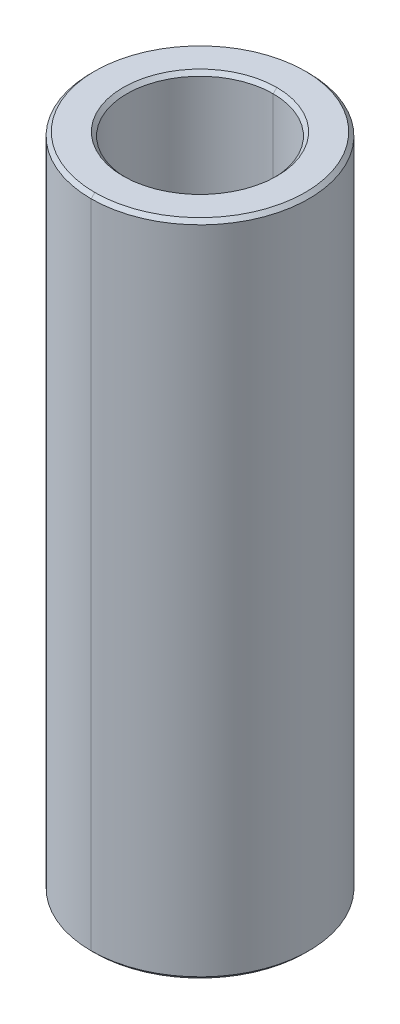
ISO-10303-21;
HEADER;
FILE_DESCRIPTION(('STEP AP214'),'2;1');
FILE_NAME('part.step','',(''),(''),'','','');
FILE_SCHEMA(('AUTOMOTIVE_DESIGN { 1 0 10303 214 1 1 1 1 }'));
ENDSEC;
DATA;
#1=APPLICATION_CONTEXT('core data for automotive mechanical design processes');
#2=APPLICATION_PROTOCOL_DEFINITION('international standard','automotive_design',2000,#1);
#3=PRODUCT_CONTEXT('',#1,'mechanical');
#4=PRODUCT('Part','Part','',(#3));
#5=PRODUCT_RELATED_PRODUCT_CATEGORY('part','',(#4));
#6=PRODUCT_DEFINITION_FORMATION('','',#4);
#7=PRODUCT_DEFINITION_CONTEXT('part definition',#1,'design');
#8=PRODUCT_DEFINITION('design','',#6,#7);
#9=PRODUCT_DEFINITION_SHAPE('','',#8);
#10=(LENGTH_UNIT() NAMED_UNIT(*) SI_UNIT(.MILLI.,.METRE.));
#11=(NAMED_UNIT(*) PLANE_ANGLE_UNIT() SI_UNIT($,.RADIAN.));
#12=(NAMED_UNIT(*) SI_UNIT($,.STERADIAN.) SOLID_ANGLE_UNIT());
#13=UNCERTAINTY_MEASURE_WITH_UNIT(LENGTH_MEASURE(1.E-05),#10,'distance_accuracy_value','');
#14=(GEOMETRIC_REPRESENTATION_CONTEXT(3) GLOBAL_UNCERTAINTY_ASSIGNED_CONTEXT((#13)) GLOBAL_UNIT_ASSIGNED_CONTEXT((#10,
#11,#12)) REPRESENTATION_CONTEXT('',''));
#15=CARTESIAN_POINT('',(0.,0.,0.));
#16=DIRECTION('',(0.,0.,1.));
#17=DIRECTION('',(1.,0.,0.));
#18=AXIS2_PLACEMENT_3D('',#15,#16,#17);
#19=CARTESIAN_POINT('',(0.,8.9,0.));
#20=DIRECTION('',(0.,1.,0.));
#21=DIRECTION('',(0.,0.,1.));
#22=AXIS2_PLACEMENT_3D('',#19,#20,#21);
#23=CONICAL_SURFACE('',#22,2.,0.785398163397448);
#24=DIRECTION('',(0.,0.707106781186548,-0.707106781186548));
#25=VECTOR('',#24,1.);
#26=CARTESIAN_POINT('',(0.,8.9,-2.));
#27=LINE('',#26,#25);
#28=CARTESIAN_POINT('',(0.,8.9,-2.));
#29=VERTEX_POINT('',#28);
#30=CARTESIAN_POINT('',(0.,9.,-2.1));
#31=VERTEX_POINT('',#30);
#32=EDGE_CURVE('E103',#29,#31,#27,.T.);
#33=ORIENTED_EDGE('',*,*,#32,.F.);
#34=CARTESIAN_POINT('',(0.,8.9,0.));
#35=DIRECTION('',(0.,1.,0.));
#36=DIRECTION('',(0.,0.,1.));
#37=AXIS2_PLACEMENT_3D('',#34,#35,#36);
#38=CIRCLE('',#37,2.);
#39=CARTESIAN_POINT('',(0.,8.9,2.));
#40=VERTEX_POINT('',#39);
#41=EDGE_CURVE('E25',#40,#29,#38,.T.);
#42=ORIENTED_EDGE('',*,*,#41,.F.);
#43=DIRECTION('',(0.,0.707106781186548,0.707106781186548));
#44=VECTOR('',#43,1.);
#45=CARTESIAN_POINT('',(0.,8.9,2.));
#46=LINE('',#45,#44);
#47=CARTESIAN_POINT('',(0.,9.,2.1));
#48=VERTEX_POINT('',#47);
#49=EDGE_CURVE('E100',#40,#48,#46,.T.);
#50=ORIENTED_EDGE('',*,*,#49,.T.);
#51=CARTESIAN_POINT('',(0.,9.,0.));
#52=DIRECTION('',(0.,-1.,0.));
#53=DIRECTION('',(0.,0.,1.));
#54=AXIS2_PLACEMENT_3D('',#51,#52,#53);
#55=CIRCLE('',#54,2.1);
#56=EDGE_CURVE('E141',#31,#48,#55,.T.);
#57=ORIENTED_EDGE('',*,*,#56,.F.);
#58=EDGE_LOOP('',(#33,#42,#50,#57));
#59=FACE_BOUND('',#58,.T.);
#60=ADVANCED_FACE('F14',(#59),#23,.F.);
#61=CARTESIAN_POINT('',(0.,-9.,0.));
#62=DIRECTION('',(0.,-1.,0.));
#63=DIRECTION('',(0.,0.,-1.));
#64=AXIS2_PLACEMENT_3D('',#61,#62,#63);
#65=CONICAL_SURFACE('',#64,2.1,0.78539816339744);
#66=DIRECTION('',(0.,-0.707106781186554,0.707106781186542));
#67=VECTOR('',#66,1.);
#68=CARTESIAN_POINT('',(0.,-9.,2.1));
#69=LINE('',#68,#67);
#70=CARTESIAN_POINT('',(0.,-8.9,2.));
#71=VERTEX_POINT('',#70);
#72=CARTESIAN_POINT('',(0.,-9.,2.1));
#73=VERTEX_POINT('',#72);
#74=EDGE_CURVE('E156',#71,#73,#69,.T.);
#75=ORIENTED_EDGE('',*,*,#74,.F.);
#76=CARTESIAN_POINT('',(0.,-8.9,0.));
#77=DIRECTION('',(0.,-1.,0.));
#78=DIRECTION('',(0.,0.,1.));
#79=AXIS2_PLACEMENT_3D('',#76,#77,#78);
#80=CIRCLE('',#79,2.);
#81=CARTESIAN_POINT('',(0.,-8.9,-2.));
#82=VERTEX_POINT('',#81);
#83=EDGE_CURVE('E9',#82,#71,#80,.T.);
#84=ORIENTED_EDGE('',*,*,#83,.F.);
#85=DIRECTION('',(0.,-0.707106781186554,-0.707106781186542));
#86=VECTOR('',#85,1.);
#87=CARTESIAN_POINT('',(0.,-9.,-2.1));
#88=LINE('',#87,#86);
#89=CARTESIAN_POINT('',(0.,-9.,-2.1));
#90=VERTEX_POINT('',#89);
#91=EDGE_CURVE('E147',#82,#90,#88,.T.);
#92=ORIENTED_EDGE('',*,*,#91,.T.);
#93=CARTESIAN_POINT('',(0.,-9.,0.));
#94=DIRECTION('',(0.,1.,0.));
#95=DIRECTION('',(0.,0.,1.));
#96=AXIS2_PLACEMENT_3D('',#93,#94,#95);
#97=CIRCLE('',#96,2.1);
#98=EDGE_CURVE('E178',#73,#90,#97,.T.);
#99=ORIENTED_EDGE('',*,*,#98,.F.);
#100=EDGE_LOOP('',(#75,#84,#92,#99));
#101=FACE_BOUND('',#100,.T.);
#102=ADVANCED_FACE('F240',(#101),#65,.F.);
#103=CARTESIAN_POINT('',(0.,9.,0.));
#104=DIRECTION('',(0.,-1.,0.));
#105=DIRECTION('',(0.,0.,-1.));
#106=AXIS2_PLACEMENT_3D('',#103,#104,#105);
#107=CONICAL_SURFACE('',#106,2.875,0.785398163397448);
#108=DIRECTION('',(0.,-0.707106781186548,0.707106781186548));
#109=VECTOR('',#108,1.);
#110=CARTESIAN_POINT('',(0.,9.,2.875));
#111=LINE('',#110,#109);
#112=CARTESIAN_POINT('',(0.,9.,2.875));
#113=VERTEX_POINT('',#112);
#114=CARTESIAN_POINT('',(0.,8.9,2.975));
#115=VERTEX_POINT('',#114);
#116=EDGE_CURVE('E171',#113,#115,#111,.T.);
#117=ORIENTED_EDGE('',*,*,#116,.F.);
#118=CARTESIAN_POINT('',(0.,9.,0.));
#119=DIRECTION('',(0.,1.,0.));
#120=DIRECTION('',(0.,0.,1.));
#121=AXIS2_PLACEMENT_3D('',#118,#119,#120);
#122=CIRCLE('',#121,2.875);
#123=CARTESIAN_POINT('',(0.,9.,-2.875));
#124=VERTEX_POINT('',#123);
#125=EDGE_CURVE('E195',#124,#113,#122,.T.);
#126=ORIENTED_EDGE('',*,*,#125,.F.);
#127=DIRECTION('',(0.,-0.707106781186548,-0.707106781186548));
#128=VECTOR('',#127,1.);
#129=CARTESIAN_POINT('',(0.,9.,-2.875));
#130=LINE('',#129,#128);
#131=CARTESIAN_POINT('',(0.,8.9,-2.975));
#132=VERTEX_POINT('',#131);
#133=EDGE_CURVE('E146',#124,#132,#130,.T.);
#134=ORIENTED_EDGE('',*,*,#133,.T.);
#135=CARTESIAN_POINT('',(0.,8.9,0.));
#136=DIRECTION('',(0.,-1.,0.));
#137=DIRECTION('',(0.,0.,1.));
#138=AXIS2_PLACEMENT_3D('',#135,#136,#137);
#139=CIRCLE('',#138,2.975);
#140=EDGE_CURVE('E18',#115,#132,#139,.T.);
#141=ORIENTED_EDGE('',*,*,#140,.F.);
#142=EDGE_LOOP('',(#117,#126,#134,#141));
#143=FACE_BOUND('',#142,.T.);
#144=ADVANCED_FACE('F245',(#143),#107,.T.);
#145=CARTESIAN_POINT('',(0.,-8.9,0.));
#146=DIRECTION('',(0.,1.,0.));
#147=DIRECTION('',(0.,0.,1.));
#148=AXIS2_PLACEMENT_3D('',#145,#146,#147);
#149=CONICAL_SURFACE('',#148,2.975,0.78539816339744);
#150=DIRECTION('',(0.,0.707106781186554,-0.707106781186542));
#151=VECTOR('',#150,1.);
#152=CARTESIAN_POINT('',(0.,-8.9,-2.975));
#153=LINE('',#152,#151);
#154=CARTESIAN_POINT('',(0.,-9.,-2.875));
#155=VERTEX_POINT('',#154);
#156=CARTESIAN_POINT('',(0.,-8.9,-2.975));
#157=VERTEX_POINT('',#156);
#158=EDGE_CURVE('E145',#155,#157,#153,.T.);
#159=ORIENTED_EDGE('',*,*,#158,.F.);
#160=CARTESIAN_POINT('',(0.,-9.,0.));
#161=DIRECTION('',(0.,-1.,0.));
#162=DIRECTION('',(0.,0.,1.));
#163=AXIS2_PLACEMENT_3D('',#160,#161,#162);
#164=CIRCLE('',#163,2.875);
#165=CARTESIAN_POINT('',(0.,-9.,2.875));
#166=VERTEX_POINT('',#165);
#167=EDGE_CURVE('E176',#166,#155,#164,.T.);
#168=ORIENTED_EDGE('',*,*,#167,.F.);
#169=DIRECTION('',(0.,0.707106781186554,0.707106781186542));
#170=VECTOR('',#169,1.);
#171=CARTESIAN_POINT('',(0.,-8.9,2.975));
#172=LINE('',#171,#170);
#173=CARTESIAN_POINT('',(0.,-8.9,2.975));
#174=VERTEX_POINT('',#173);
#175=EDGE_CURVE('E120',#166,#174,#172,.T.);
#176=ORIENTED_EDGE('',*,*,#175,.T.);
#177=CARTESIAN_POINT('',(0.,-8.9,0.));
#178=DIRECTION('',(0.,1.,0.));
#179=DIRECTION('',(0.,0.,1.));
#180=AXIS2_PLACEMENT_3D('',#177,#178,#179);
#181=CIRCLE('',#180,2.975);
#182=EDGE_CURVE('E39',#157,#174,#181,.T.);
#183=ORIENTED_EDGE('',*,*,#182,.F.);
#184=EDGE_LOOP('',(#159,#168,#176,#183));
#185=FACE_BOUND('',#184,.T.);
#186=ADVANCED_FACE('F225',(#185),#149,.T.);
#187=CARTESIAN_POINT('',(0.,9.,0.));
#188=DIRECTION('',(0.,-1.,0.));
#189=DIRECTION('',(0.,0.,-1.));
#190=AXIS2_PLACEMENT_3D('',#187,#188,#189);
#191=CYLINDRICAL_SURFACE('',#190,2.);
#192=DIRECTION('',(0.,-1.,0.));
#193=VECTOR('',#192,1.);
#194=CARTESIAN_POINT('',(0.,9.,2.));
#195=LINE('',#194,#193);
#196=EDGE_CURVE('E111',#40,#71,#195,.T.);
#197=ORIENTED_EDGE('',*,*,#196,.F.);
#198=ORIENTED_EDGE('',*,*,#41,.T.);
#199=DIRECTION('',(0.,-1.,0.));
#200=VECTOR('',#199,1.);
#201=CARTESIAN_POINT('',(0.,9.,-2.));
#202=LINE('',#201,#200);
#203=EDGE_CURVE('E119',#29,#82,#202,.T.);
#204=ORIENTED_EDGE('',*,*,#203,.T.);
#205=ORIENTED_EDGE('',*,*,#83,.T.);
#206=EDGE_LOOP('',(#197,#198,#204,#205));
#207=FACE_BOUND('',#206,.T.);
#208=ADVANCED_FACE('F112',(#207),#191,.F.);
#209=CARTESIAN_POINT('',(0.,9.,0.));
#210=DIRECTION('',(0.,-1.,0.));
#211=DIRECTION('',(0.,0.,-1.));
#212=AXIS2_PLACEMENT_3D('',#209,#210,#211);
#213=CYLINDRICAL_SURFACE('',#212,2.975);
#214=DIRECTION('',(0.,-1.,0.));
#215=VECTOR('',#214,1.);
#216=CARTESIAN_POINT('',(0.,9.,2.975));
#217=LINE('',#216,#215);
#218=EDGE_CURVE('E161',#115,#174,#217,.T.);
#219=ORIENTED_EDGE('',*,*,#218,.F.);
#220=ORIENTED_EDGE('',*,*,#140,.T.);
#221=DIRECTION('',(0.,-1.,0.));
#222=VECTOR('',#221,1.);
#223=CARTESIAN_POINT('',(0.,9.,-2.975));
#224=LINE('',#223,#222);
#225=EDGE_CURVE('E163',#132,#157,#224,.T.);
#226=ORIENTED_EDGE('',*,*,#225,.T.);
#227=ORIENTED_EDGE('',*,*,#182,.T.);
#228=EDGE_LOOP('',(#219,#220,#226,#227));
#229=FACE_BOUND('',#228,.T.);
#230=ADVANCED_FACE('F226',(#229),#213,.T.);
#231=CARTESIAN_POINT('',(0.,-9.,0.));
#232=DIRECTION('',(0.,1.,0.));
#233=DIRECTION('',(1.,0.,0.));
#234=AXIS2_PLACEMENT_3D('',#231,#232,#233);
#235=PLANE('',#234);
#236=CARTESIAN_POINT('',(0.,-9.,0.));
#237=DIRECTION('',(0.,1.,0.));
#238=DIRECTION('',(0.,0.,1.));
#239=AXIS2_PLACEMENT_3D('',#236,#237,#238);
#240=CIRCLE('',#239,2.1);
#241=EDGE_CURVE('E152',#90,#73,#240,.T.);
#242=ORIENTED_EDGE('',*,*,#241,.T.);
#243=ORIENTED_EDGE('',*,*,#98,.T.);
#244=EDGE_LOOP('',(#242,#243));
#245=FACE_BOUND('',#244,.T.);
#246=ORIENTED_EDGE('',*,*,#167,.T.);
#247=CARTESIAN_POINT('',(0.,-9.,0.));
#248=DIRECTION('',(0.,-1.,0.));
#249=DIRECTION('',(0.,0.,1.));
#250=AXIS2_PLACEMENT_3D('',#247,#248,#249);
#251=CIRCLE('',#250,2.875);
#252=EDGE_CURVE('E142',#155,#166,#251,.T.);
#253=ORIENTED_EDGE('',*,*,#252,.T.);
#254=EDGE_LOOP('',(#246,#253));
#255=FACE_BOUND('',#254,.T.);
#256=ADVANCED_FACE('F228',(#245,#255),#235,.F.);
#257=CARTESIAN_POINT('',(0.,9.,0.));
#258=DIRECTION('',(0.,1.,0.));
#259=DIRECTION('',(1.,0.,0.));
#260=AXIS2_PLACEMENT_3D('',#257,#258,#259);
#261=PLANE('',#260);
#262=CARTESIAN_POINT('',(0.,9.,0.));
#263=DIRECTION('',(0.,-1.,0.));
#264=DIRECTION('',(0.,0.,1.));
#265=AXIS2_PLACEMENT_3D('',#262,#263,#264);
#266=CIRCLE('',#265,2.1);
#267=EDGE_CURVE('E126',#48,#31,#266,.T.);
#268=ORIENTED_EDGE('',*,*,#267,.T.);
#269=ORIENTED_EDGE('',*,*,#56,.T.);
#270=EDGE_LOOP('',(#268,#269));
#271=FACE_BOUND('',#270,.T.);
#272=ORIENTED_EDGE('',*,*,#125,.T.);
#273=CARTESIAN_POINT('',(0.,9.,0.));
#274=DIRECTION('',(0.,1.,0.));
#275=DIRECTION('',(0.,0.,1.));
#276=AXIS2_PLACEMENT_3D('',#273,#274,#275);
#277=CIRCLE('',#276,2.875);
#278=EDGE_CURVE('E151',#113,#124,#277,.T.);
#279=ORIENTED_EDGE('',*,*,#278,.T.);
#280=EDGE_LOOP('',(#272,#279));
#281=FACE_BOUND('',#280,.T.);
#282=ADVANCED_FACE('F235',(#271,#281),#261,.T.);
#283=CARTESIAN_POINT('',(0.,9.,0.));
#284=DIRECTION('',(0.,-1.,0.));
#285=DIRECTION('',(0.,0.,-1.));
#286=AXIS2_PLACEMENT_3D('',#283,#284,#285);
#287=CYLINDRICAL_SURFACE('',#286,2.975);
#288=CARTESIAN_POINT('',(0.,8.9,0.));
#289=DIRECTION('',(0.,-1.,0.));
#290=DIRECTION('',(0.,0.,1.));
#291=AXIS2_PLACEMENT_3D('',#288,#289,#290);
#292=CIRCLE('',#291,2.975);
#293=EDGE_CURVE('E175',#132,#115,#292,.T.);
#294=ORIENTED_EDGE('',*,*,#293,.T.);
#295=ORIENTED_EDGE('',*,*,#218,.T.);
#296=CARTESIAN_POINT('',(0.,-8.9,0.));
#297=DIRECTION('',(0.,1.,0.));
#298=DIRECTION('',(0.,0.,1.));
#299=AXIS2_PLACEMENT_3D('',#296,#297,#298);
#300=CIRCLE('',#299,2.975);
#301=EDGE_CURVE('E160',#174,#157,#300,.T.);
#302=ORIENTED_EDGE('',*,*,#301,.T.);
#303=ORIENTED_EDGE('',*,*,#225,.F.);
#304=EDGE_LOOP('',(#294,#295,#302,#303));
#305=FACE_BOUND('',#304,.T.);
#306=ADVANCED_FACE('F16',(#305),#287,.T.);
#307=CARTESIAN_POINT('',(0.,9.,0.));
#308=DIRECTION('',(0.,-1.,0.));
#309=DIRECTION('',(0.,0.,-1.));
#310=AXIS2_PLACEMENT_3D('',#307,#308,#309);
#311=CYLINDRICAL_SURFACE('',#310,2.);
#312=CARTESIAN_POINT('',(0.,8.9,0.));
#313=DIRECTION('',(0.,1.,0.));
#314=DIRECTION('',(0.,0.,1.));
#315=AXIS2_PLACEMENT_3D('',#312,#313,#314);
#316=CIRCLE('',#315,2.);
#317=EDGE_CURVE('E124',#29,#40,#316,.T.);
#318=ORIENTED_EDGE('',*,*,#317,.T.);
#319=ORIENTED_EDGE('',*,*,#196,.T.);
#320=CARTESIAN_POINT('',(0.,-8.9,0.));
#321=DIRECTION('',(0.,-1.,0.));
#322=DIRECTION('',(0.,0.,1.));
#323=AXIS2_PLACEMENT_3D('',#320,#321,#322);
#324=CIRCLE('',#323,2.);
#325=EDGE_CURVE('E128',#71,#82,#324,.T.);
#326=ORIENTED_EDGE('',*,*,#325,.T.);
#327=ORIENTED_EDGE('',*,*,#203,.F.);
#328=EDGE_LOOP('',(#318,#319,#326,#327));
#329=FACE_BOUND('',#328,.T.);
#330=ADVANCED_FACE('F130',(#329),#311,.F.);
#331=CARTESIAN_POINT('',(0.,-8.9,0.));
#332=DIRECTION('',(0.,1.,0.));
#333=DIRECTION('',(0.,0.,1.));
#334=AXIS2_PLACEMENT_3D('',#331,#332,#333);
#335=CONICAL_SURFACE('',#334,2.975,0.78539816339744);
#336=ORIENTED_EDGE('',*,*,#252,.F.);
#337=ORIENTED_EDGE('',*,*,#158,.T.);
#338=ORIENTED_EDGE('',*,*,#301,.F.);
#339=ORIENTED_EDGE('',*,*,#175,.F.);
#340=EDGE_LOOP('',(#336,#337,#338,#339));
#341=FACE_BOUND('',#340,.T.);
#342=ADVANCED_FACE('F223',(#341),#335,.T.);
#343=CARTESIAN_POINT('',(0.,9.,0.));
#344=DIRECTION('',(0.,-1.,0.));
#345=DIRECTION('',(0.,0.,-1.));
#346=AXIS2_PLACEMENT_3D('',#343,#344,#345);
#347=CONICAL_SURFACE('',#346,2.875,0.785398163397448);
#348=ORIENTED_EDGE('',*,*,#278,.F.);
#349=ORIENTED_EDGE('',*,*,#116,.T.);
#350=ORIENTED_EDGE('',*,*,#293,.F.);
#351=ORIENTED_EDGE('',*,*,#133,.F.);
#352=EDGE_LOOP('',(#348,#349,#350,#351));
#353=FACE_BOUND('',#352,.T.);
#354=ADVANCED_FACE('F255',(#353),#347,.T.);
#355=CARTESIAN_POINT('',(0.,-9.,0.));
#356=DIRECTION('',(0.,-1.,0.));
#357=DIRECTION('',(0.,0.,-1.));
#358=AXIS2_PLACEMENT_3D('',#355,#356,#357);
#359=CONICAL_SURFACE('',#358,2.1,0.78539816339744);
#360=ORIENTED_EDGE('',*,*,#325,.F.);
#361=ORIENTED_EDGE('',*,*,#74,.T.);
#362=ORIENTED_EDGE('',*,*,#241,.F.);
#363=ORIENTED_EDGE('',*,*,#91,.F.);
#364=EDGE_LOOP('',(#360,#361,#362,#363));
#365=FACE_BOUND('',#364,.T.);
#366=ADVANCED_FACE('F251',(#365),#359,.F.);
#367=CARTESIAN_POINT('',(0.,8.9,0.));
#368=DIRECTION('',(0.,1.,0.));
#369=DIRECTION('',(0.,0.,1.));
#370=AXIS2_PLACEMENT_3D('',#367,#368,#369);
#371=CONICAL_SURFACE('',#370,2.,0.785398163397448);
#372=ORIENTED_EDGE('',*,*,#317,.F.);
#373=ORIENTED_EDGE('',*,*,#32,.T.);
#374=ORIENTED_EDGE('',*,*,#267,.F.);
#375=ORIENTED_EDGE('',*,*,#49,.F.);
#376=EDGE_LOOP('',(#372,#373,#374,#375));
#377=FACE_BOUND('',#376,.T.);
#378=ADVANCED_FACE('F123',(#377),#371,.F.);
#379=CLOSED_SHELL('',(#60,#102,#144,#186,#208,#230,#256,#282,#306,#330,#342,#354,#366,#378));
#380=MANIFOLD_SOLID_BREP('B1',#379);
#381=ADVANCED_BREP_SHAPE_REPRESENTATION('',(#18,#380),#14);
#382=SHAPE_DEFINITION_REPRESENTATION(#9,#381);
ENDSEC;
END-ISO-10303-21;
